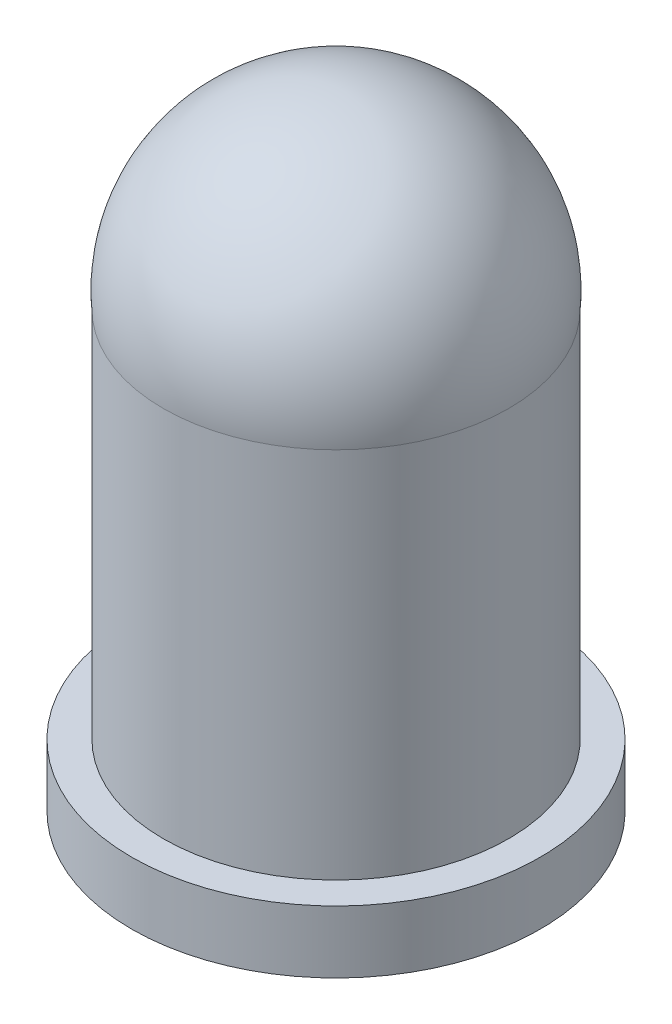
ISO-10303-21;
HEADER;
FILE_DESCRIPTION(('STEP AP214'),'2;1');
FILE_NAME('part.step','',(''),(''),'','','');
FILE_SCHEMA(('AUTOMOTIVE_DESIGN { 1 0 10303 214 1 1 1 1 }'));
ENDSEC;
DATA;
#1=APPLICATION_CONTEXT('core data for automotive mechanical design processes');
#2=APPLICATION_PROTOCOL_DEFINITION('international standard','automotive_design',2000,#1);
#3=PRODUCT_CONTEXT('',#1,'mechanical');
#4=PRODUCT('Part','Part','',(#3));
#5=PRODUCT_RELATED_PRODUCT_CATEGORY('part','',(#4));
#6=PRODUCT_DEFINITION_FORMATION('','',#4);
#7=PRODUCT_DEFINITION_CONTEXT('part definition',#1,'design');
#8=PRODUCT_DEFINITION('design','',#6,#7);
#9=PRODUCT_DEFINITION_SHAPE('','',#8);
#10=(LENGTH_UNIT() NAMED_UNIT(*) SI_UNIT(.MILLI.,.METRE.));
#11=(NAMED_UNIT(*) PLANE_ANGLE_UNIT() SI_UNIT($,.RADIAN.));
#12=(NAMED_UNIT(*) SI_UNIT($,.STERADIAN.) SOLID_ANGLE_UNIT());
#13=UNCERTAINTY_MEASURE_WITH_UNIT(LENGTH_MEASURE(1.E-05),#10,'distance_accuracy_value','');
#14=(GEOMETRIC_REPRESENTATION_CONTEXT(3) GLOBAL_UNCERTAINTY_ASSIGNED_CONTEXT((#13)) GLOBAL_UNIT_ASSIGNED_CONTEXT((#10,
#11,#12)) REPRESENTATION_CONTEXT('',''));
#15=CARTESIAN_POINT('',(0.,0.,0.));
#16=DIRECTION('',(0.,0.,1.));
#17=DIRECTION('',(1.,0.,0.));
#18=AXIS2_PLACEMENT_3D('',#15,#16,#17);
#19=CARTESIAN_POINT('',(0.,6.50000041529348,-0.0014409951988913));
#20=DIRECTION('',(-1.,0.,0.));
#21=DIRECTION('',(0.,0.,-1.));
#22=AXIS2_PLACEMENT_3D('',#19,#20,#21);
#23=CIRCLE('',#22,2.5);
#24=TRIMMED_CURVE('',#23,(PARAMETER_VALUE(-1.57137272490637)),
(PARAMETER_VALUE(1.57137272490637)),.T.,.PARAMETER.);
#25=CARTESIAN_POINT('',(0.,6.50000041529348,0.));
#26=DIRECTION('',(0.,-1.,0.));
#27=AXIS1_PLACEMENT('',#25,#26);
#28=SURFACE_OF_REVOLUTION('',#24,#27);
#29=CARTESIAN_POINT('',(0.,8.99999999999999,0.));
#30=VERTEX_POINT('',#29);
#31=VERTEX_LOOP('',#30);
#32=FACE_BOUND('',#31,.T.);
#33=CARTESIAN_POINT('',(0.,6.27701216800489,0.));
#34=DIRECTION('',(0.,1.,0.));
#35=DIRECTION('',(-1.,0.,0.));
#36=AXIS2_PLACEMENT_3D('',#33,#34,#35);
#37=CIRCLE('',#36,2.49147638482112);
#38=CARTESIAN_POINT('',(-2.49147638482112,6.27701216800489,0.));
#39=VERTEX_POINT('',#38);
#40=EDGE_CURVE('E33',#39,#39,#37,.F.);
#41=ORIENTED_EDGE('',*,*,#40,.F.);
#42=EDGE_LOOP('',(#41));
#43=FACE_BOUND('',#42,.T.);
#44=ADVANCED_FACE('F17',(#32,#43),#28,.T.);
#45=CARTESIAN_POINT('',(0.,6.27701216800489,0.));
#46=DIRECTION('',(0.,1.,0.));
#47=DIRECTION('',(0.,0.,1.));
#48=AXIS2_PLACEMENT_3D('',#45,#46,#47);
#49=CYLINDRICAL_SURFACE('',#48,2.49147638482112);
#50=CARTESIAN_POINT('',(0.,0.9,0.));
#51=DIRECTION('',(0.,1.,0.));
#52=DIRECTION('',(0.,0.,1.));
#53=AXIS2_PLACEMENT_3D('',#50,#51,#52);
#54=CIRCLE('',#53,2.49147638482112);
#55=CARTESIAN_POINT('',(0.,0.899999999999999,2.49147638482112));
#56=VERTEX_POINT('',#55);
#57=EDGE_CURVE('E20',#56,#56,#54,.F.);
#58=ORIENTED_EDGE('',*,*,#57,.F.);
#59=EDGE_LOOP('',(#58));
#60=FACE_BOUND('',#59,.T.);
#61=ORIENTED_EDGE('',*,*,#40,.T.);
#62=EDGE_LOOP('',(#61));
#63=FACE_BOUND('',#62,.T.);
#64=ADVANCED_FACE('F30',(#60,#63),#49,.T.);
#65=CARTESIAN_POINT('',(-3.245,0.899999999999999,-3.245));
#66=DIRECTION('',(0.,1.,0.));
#67=DIRECTION('',(0.,0.,1.));
#68=AXIS2_PLACEMENT_3D('',#65,#66,#67);
#69=PLANE('',#68);
#70=ORIENTED_EDGE('',*,*,#57,.T.);
#71=EDGE_LOOP('',(#70));
#72=FACE_BOUND('',#71,.T.);
#73=CARTESIAN_POINT('',(0.,0.899999999999999,0.));
#74=DIRECTION('',(0.,1.,0.));
#75=DIRECTION('',(0.,0.,1.));
#76=AXIS2_PLACEMENT_3D('',#73,#74,#75);
#77=CIRCLE('',#76,2.95000000000001);
#78=CARTESIAN_POINT('',(0.,0.899999999999999,2.95000000000001));
#79=VERTEX_POINT('',#78);
#80=EDGE_CURVE('E24',#79,#79,#77,.F.);
#81=ORIENTED_EDGE('',*,*,#80,.F.);
#82=EDGE_LOOP('',(#81));
#83=FACE_BOUND('',#82,.T.);
#84=ADVANCED_FACE('F44',(#72,#83),#69,.T.);
#85=CARTESIAN_POINT('',(0.,0.899999999999999,0.));
#86=DIRECTION('',(0.,1.,0.));
#87=DIRECTION('',(0.,0.,1.));
#88=AXIS2_PLACEMENT_3D('',#85,#86,#87);
#89=CYLINDRICAL_SURFACE('',#88,2.95000000000001);
#90=CARTESIAN_POINT('',(0.,0.,0.));
#91=DIRECTION('',(0.,1.,0.));
#92=DIRECTION('',(0.,0.,1.));
#93=AXIS2_PLACEMENT_3D('',#90,#91,#92);
#94=CIRCLE('',#93,2.95000000000001);
#95=CARTESIAN_POINT('',(0.,0.,2.95000000000001));
#96=VERTEX_POINT('',#95);
#97=EDGE_CURVE('E11',#96,#96,#94,.F.);
#98=ORIENTED_EDGE('',*,*,#97,.F.);
#99=EDGE_LOOP('',(#98));
#100=FACE_BOUND('',#99,.T.);
#101=ORIENTED_EDGE('',*,*,#80,.T.);
#102=EDGE_LOOP('',(#101));
#103=FACE_BOUND('',#102,.T.);
#104=ADVANCED_FACE('F42',(#100,#103),#89,.T.);
#105=CARTESIAN_POINT('',(-3.245,0.,3.245));
#106=DIRECTION('',(0.,-1.,0.));
#107=DIRECTION('',(0.,0.,-1.));
#108=AXIS2_PLACEMENT_3D('',#105,#106,#107);
#109=PLANE('',#108);
#110=ORIENTED_EDGE('',*,*,#97,.T.);
#111=EDGE_LOOP('',(#110));
#112=FACE_BOUND('',#111,.T.);
#113=ADVANCED_FACE('F53',(#112),#109,.T.);
#114=CLOSED_SHELL('',(#44,#64,#84,#104,#113));
#115=MANIFOLD_SOLID_BREP('B1',#114);
#116=ADVANCED_BREP_SHAPE_REPRESENTATION('',(#18,#115),#14);
#117=SHAPE_DEFINITION_REPRESENTATION(#9,#116);
ENDSEC;
END-ISO-10303-21;
